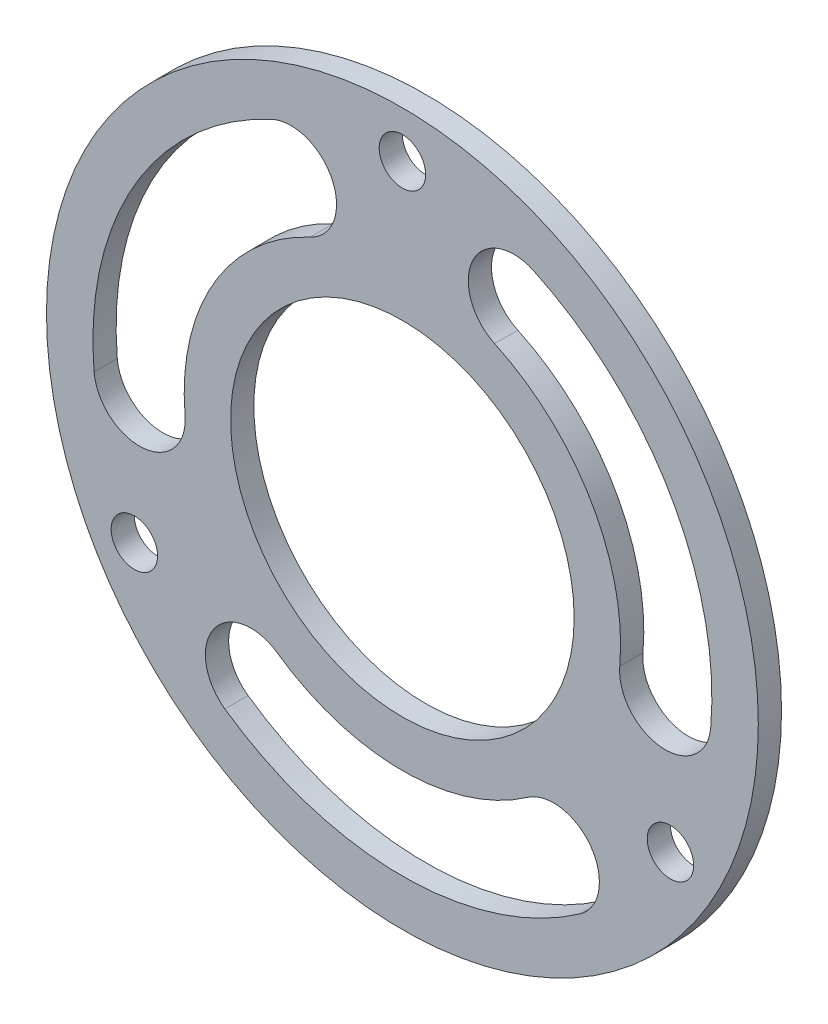
ISO-10303-21;
HEADER;
FILE_DESCRIPTION(('STEP AP214'),'2;1');
FILE_NAME('part.step','',(''),(''),'','','');
FILE_SCHEMA(('AUTOMOTIVE_DESIGN { 1 0 10303 214 1 1 1 1 }'));
ENDSEC;
DATA;
#1=APPLICATION_CONTEXT('core data for automotive mechanical design processes');
#2=APPLICATION_PROTOCOL_DEFINITION('international standard','automotive_design',2000,#1);
#3=PRODUCT_CONTEXT('',#1,'mechanical');
#4=PRODUCT('Part','Part','',(#3));
#5=PRODUCT_RELATED_PRODUCT_CATEGORY('part','',(#4));
#6=PRODUCT_DEFINITION_FORMATION('','',#4);
#7=PRODUCT_DEFINITION_CONTEXT('part definition',#1,'design');
#8=PRODUCT_DEFINITION('design','',#6,#7);
#9=PRODUCT_DEFINITION_SHAPE('','',#8);
#10=(LENGTH_UNIT() NAMED_UNIT(*) SI_UNIT(.MILLI.,.METRE.));
#11=(NAMED_UNIT(*) PLANE_ANGLE_UNIT() SI_UNIT($,.RADIAN.));
#12=(NAMED_UNIT(*) SI_UNIT($,.STERADIAN.) SOLID_ANGLE_UNIT());
#13=UNCERTAINTY_MEASURE_WITH_UNIT(LENGTH_MEASURE(1.E-05),#10,'distance_accuracy_value','');
#14=(GEOMETRIC_REPRESENTATION_CONTEXT(3) GLOBAL_UNCERTAINTY_ASSIGNED_CONTEXT((#13)) GLOBAL_UNIT_ASSIGNED_CONTEXT((#10,
#11,#12)) REPRESENTATION_CONTEXT('',''));
#15=CARTESIAN_POINT('',(0.,0.,0.));
#16=DIRECTION('',(0.,0.,1.));
#17=DIRECTION('',(1.,0.,0.));
#18=AXIS2_PLACEMENT_3D('',#15,#16,#17);
#19=CARTESIAN_POINT('',(0.,0.,1.5));
#20=DIRECTION('',(0.,0.,1.));
#21=DIRECTION('',(1.,0.,0.));
#22=AXIS2_PLACEMENT_3D('',#19,#20,#21);
#23=PLANE('',#22);
#24=CARTESIAN_POINT('',(-9.77947823978542,-13.9665423551273,1.5));
#25=DIRECTION('',(0.,0.,1.));
#26=DIRECTION('',(1.,0.,0.));
#27=AXIS2_PLACEMENT_3D('',#24,#25,#26);
#28=CIRCLE('',#27,2.95000000000001);
#29=CARTESIAN_POINT('',(-8.08742775254981,-11.5500438244747,1.5));
#30=VERTEX_POINT('',#29);
#31=CARTESIAN_POINT('',(-11.471528727021,-16.3830408857798,1.5));
#32=VERTEX_POINT('',#31);
#33=EDGE_CURVE('E49',#30,#32,#28,.T.);
#34=ORIENTED_EDGE('',*,*,#33,.F.);
#35=CARTESIAN_POINT('',(0.,0.,1.5));
#36=DIRECTION('',(0.,0.,-1.));
#37=DIRECTION('',(1.,0.,0.));
#38=AXIS2_PLACEMENT_3D('',#35,#36,#37);
#39=CIRCLE('',#38,14.1);
#40=CARTESIAN_POINT('',(8.08742775254982,-11.5500438244747,1.5));
#41=VERTEX_POINT('',#40);
#42=EDGE_CURVE('E168',#41,#30,#39,.T.);
#43=ORIENTED_EDGE('',*,*,#42,.F.);
#44=CARTESIAN_POINT('',(9.77947823978542,-13.9665423551272,1.5));
#45=DIRECTION('',(0.,0.,1.));
#46=DIRECTION('',(1.,0.,0.));
#47=AXIS2_PLACEMENT_3D('',#44,#45,#46);
#48=CIRCLE('',#47,2.95);
#49=CARTESIAN_POINT('',(11.471528727021,-16.3830408857798,1.5));
#50=VERTEX_POINT('',#49);
#51=EDGE_CURVE('E182',#50,#41,#48,.T.);
#52=ORIENTED_EDGE('',*,*,#51,.F.);
#53=CARTESIAN_POINT('',(0.,0.,1.5));
#54=DIRECTION('',(0.,0.,1.));
#55=DIRECTION('',(1.,0.,0.));
#56=AXIS2_PLACEMENT_3D('',#53,#54,#55);
#57=CIRCLE('',#56,20.);
#58=EDGE_CURVE('E179',#32,#50,#57,.T.);
#59=ORIENTED_EDGE('',*,*,#58,.F.);
#60=EDGE_LOOP('',(#34,#43,#52,#59));
#61=FACE_BOUND('',#60,.T.);
#62=CARTESIAN_POINT('',(16.9851196024642,-1.48600541384767,1.5));
#63=DIRECTION('',(0.,0.,1.));
#64=DIRECTION('',(1.,0.,0.));
#65=AXIS2_PLACEMENT_3D('',#62,#63,#64);
#66=CIRCLE('',#65,2.95);
#67=CARTESIAN_POINT('',(14.0463452430936,-1.22889597274206,1.5));
#68=VERTEX_POINT('',#67);
#69=CARTESIAN_POINT('',(19.9238939618349,-1.74311485495327,1.5));
#70=VERTEX_POINT('',#69);
#71=EDGE_CURVE('E57',#68,#70,#66,.T.);
#72=ORIENTED_EDGE('',*,*,#71,.F.);
#73=CARTESIAN_POINT('',(0.,0.,1.5));
#74=DIRECTION('',(0.,0.,-1.));
#75=DIRECTION('',(1.,0.,0.));
#76=AXIS2_PLACEMENT_3D('',#73,#74,#75);
#77=CIRCLE('',#76,14.1);
#78=CARTESIAN_POINT('',(5.95891749054378,12.7789397972168,1.5));
#79=VERTEX_POINT('',#78);
#80=EDGE_CURVE('E144',#79,#68,#77,.T.);
#81=ORIENTED_EDGE('',*,*,#80,.F.);
#82=CARTESIAN_POINT('',(7.20564136267882,15.4525477689749,1.5));
#83=DIRECTION('',(0.,0.,1.));
#84=DIRECTION('',(1.,0.,0.));
#85=AXIS2_PLACEMENT_3D('',#82,#83,#84);
#86=CIRCLE('',#85,2.95);
#87=CARTESIAN_POINT('',(8.45236523481387,18.1261557407331,1.5));
#88=VERTEX_POINT('',#87);
#89=EDGE_CURVE('E147',#88,#79,#86,.T.);
#90=ORIENTED_EDGE('',*,*,#89,.F.);
#91=CARTESIAN_POINT('',(0.,0.,1.5));
#92=DIRECTION('',(0.,0.,1.));
#93=DIRECTION('',(1.,0.,0.));
#94=AXIS2_PLACEMENT_3D('',#91,#92,#93);
#95=CIRCLE('',#94,20.);
#96=EDGE_CURVE('E153',#70,#88,#95,.T.);
#97=ORIENTED_EDGE('',*,*,#96,.F.);
#98=EDGE_LOOP('',(#72,#81,#90,#97));
#99=FACE_BOUND('',#98,.T.);
#100=CARTESIAN_POINT('',(-7.20564136267883,15.4525477689749,1.5));
#101=DIRECTION('',(0.,0.,1.));
#102=DIRECTION('',(1.,0.,0.));
#103=AXIS2_PLACEMENT_3D('',#100,#101,#102);
#104=CIRCLE('',#103,2.95);
#105=CARTESIAN_POINT('',(-5.95891749054379,12.7789397972168,1.5));
#106=VERTEX_POINT('',#105);
#107=CARTESIAN_POINT('',(-8.45236523481388,18.1261557407331,1.5));
#108=VERTEX_POINT('',#107);
#109=EDGE_CURVE('E160',#106,#108,#104,.T.);
#110=ORIENTED_EDGE('',*,*,#109,.F.);
#111=CARTESIAN_POINT('',(0.,0.,1.5));
#112=DIRECTION('',(0.,0.,-1.));
#113=DIRECTION('',(1.,0.,0.));
#114=AXIS2_PLACEMENT_3D('',#111,#112,#113);
#115=CIRCLE('',#114,14.1);
#116=CARTESIAN_POINT('',(-14.0463452430936,-1.22889597274207,1.5));
#117=VERTEX_POINT('',#116);
#118=EDGE_CURVE('E197',#117,#106,#115,.T.);
#119=ORIENTED_EDGE('',*,*,#118,.F.);
#120=CARTESIAN_POINT('',(-16.9851196024642,-1.48600541384768,1.5));
#121=DIRECTION('',(0.,0.,1.));
#122=DIRECTION('',(1.,0.,0.));
#123=AXIS2_PLACEMENT_3D('',#120,#121,#122);
#124=CIRCLE('',#123,2.95);
#125=CARTESIAN_POINT('',(-19.9238939618349,-1.74311485495329,1.5));
#126=VERTEX_POINT('',#125);
#127=EDGE_CURVE('E211',#126,#117,#124,.T.);
#128=ORIENTED_EDGE('',*,*,#127,.F.);
#129=CARTESIAN_POINT('',(0.,0.,1.5));
#130=DIRECTION('',(0.,0.,1.));
#131=DIRECTION('',(1.,0.,0.));
#132=AXIS2_PLACEMENT_3D('',#129,#130,#131);
#133=CIRCLE('',#132,20.);
#134=EDGE_CURVE('E208',#108,#126,#133,.T.);
#135=ORIENTED_EDGE('',*,*,#134,.F.);
#136=EDGE_LOOP('',(#110,#119,#128,#135));
#137=FACE_BOUND('',#136,.T.);
#138=CARTESIAN_POINT('',(-17.3205080756888,-10.,1.5));
#139=DIRECTION('',(0.,0.,1.));
#140=DIRECTION('',(1.,0.,0.));
#141=AXIS2_PLACEMENT_3D('',#138,#139,#140);
#142=CIRCLE('',#141,1.5);
#143=CARTESIAN_POINT('',(-15.8205080756888,-10.,1.5));
#144=VERTEX_POINT('',#143);
#145=EDGE_CURVE('E231',#144,#144,#142,.T.);
#146=ORIENTED_EDGE('',*,*,#145,.F.);
#147=EDGE_LOOP('',(#146));
#148=FACE_BOUND('',#147,.T.);
#149=CARTESIAN_POINT('',(0.,20.,1.5));
#150=DIRECTION('',(0.,0.,1.));
#151=DIRECTION('',(1.,0.,0.));
#152=AXIS2_PLACEMENT_3D('',#149,#150,#151);
#153=CIRCLE('',#152,1.5);
#154=CARTESIAN_POINT('',(1.5,20.,1.5));
#155=VERTEX_POINT('',#154);
#156=EDGE_CURVE('E243',#155,#155,#153,.T.);
#157=ORIENTED_EDGE('',*,*,#156,.F.);
#158=EDGE_LOOP('',(#157));
#159=FACE_BOUND('',#158,.T.);
#160=CARTESIAN_POINT('',(0.,0.,1.5));
#161=DIRECTION('',(0.,0.,1.));
#162=DIRECTION('',(1.,0.,0.));
#163=AXIS2_PLACEMENT_3D('',#160,#161,#162);
#164=CIRCLE('',#163,23.);
#165=CARTESIAN_POINT('',(23.,0.,1.5));
#166=VERTEX_POINT('',#165);
#167=EDGE_CURVE('E11',#166,#166,#164,.T.);
#168=ORIENTED_EDGE('',*,*,#167,.T.);
#169=EDGE_LOOP('',(#168));
#170=FACE_BOUND('',#169,.T.);
#171=CARTESIAN_POINT('',(17.3205080756888,-10.,1.5));
#172=DIRECTION('',(0.,0.,1.));
#173=DIRECTION('',(1.,0.,0.));
#174=AXIS2_PLACEMENT_3D('',#171,#172,#173);
#175=CIRCLE('',#174,1.5);
#176=CARTESIAN_POINT('',(18.8205080756888,-10.,1.5));
#177=VERTEX_POINT('',#176);
#178=EDGE_CURVE('E237',#177,#177,#175,.T.);
#179=ORIENTED_EDGE('',*,*,#178,.F.);
#180=EDGE_LOOP('',(#179));
#181=FACE_BOUND('',#180,.T.);
#182=CARTESIAN_POINT('',(0.,0.,1.5));
#183=DIRECTION('',(0.,0.,1.));
#184=DIRECTION('',(1.,0.,0.));
#185=AXIS2_PLACEMENT_3D('',#182,#183,#184);
#186=CIRCLE('',#185,11.1);
#187=CARTESIAN_POINT('',(11.1,0.,1.5));
#188=VERTEX_POINT('',#187);
#189=EDGE_CURVE('E225',#188,#188,#186,.T.);
#190=ORIENTED_EDGE('',*,*,#189,.F.);
#191=EDGE_LOOP('',(#190));
#192=FACE_BOUND('',#191,.T.);
#193=ADVANCED_FACE('F34',(#61,#99,#137,#148,#159,#170,#181,#192),#23,.T.);
#194=CARTESIAN_POINT('',(0.,0.,0.));
#195=DIRECTION('',(0.,0.,1.));
#196=DIRECTION('',(1.,0.,0.));
#197=AXIS2_PLACEMENT_3D('',#194,#195,#196);
#198=PLANE('',#197);
#199=CARTESIAN_POINT('',(0.,0.,0.));
#200=DIRECTION('',(0.,0.,-1.));
#201=DIRECTION('',(1.,0.,0.));
#202=AXIS2_PLACEMENT_3D('',#199,#200,#201);
#203=CIRCLE('',#202,14.1);
#204=CARTESIAN_POINT('',(8.08742775254982,-11.5500438244747,0.));
#205=VERTEX_POINT('',#204);
#206=CARTESIAN_POINT('',(-8.08742775254981,-11.5500438244747,0.));
#207=VERTEX_POINT('',#206);
#208=EDGE_CURVE('E174',#205,#207,#203,.T.);
#209=ORIENTED_EDGE('',*,*,#208,.T.);
#210=CARTESIAN_POINT('',(-9.77947823978542,-13.9665423551273,0.));
#211=DIRECTION('',(0.,0.,1.));
#212=DIRECTION('',(1.,0.,0.));
#213=AXIS2_PLACEMENT_3D('',#210,#211,#212);
#214=CIRCLE('',#213,2.95000000000001);
#215=CARTESIAN_POINT('',(-11.471528727021,-16.3830408857798,0.));
#216=VERTEX_POINT('',#215);
#217=EDGE_CURVE('E164',#207,#216,#214,.T.);
#218=ORIENTED_EDGE('',*,*,#217,.T.);
#219=CARTESIAN_POINT('',(0.,0.,0.));
#220=DIRECTION('',(0.,0.,1.));
#221=DIRECTION('',(1.,0.,0.));
#222=AXIS2_PLACEMENT_3D('',#219,#220,#221);
#223=CIRCLE('',#222,20.);
#224=CARTESIAN_POINT('',(11.471528727021,-16.3830408857798,0.));
#225=VERTEX_POINT('',#224);
#226=EDGE_CURVE('E167',#216,#225,#223,.T.);
#227=ORIENTED_EDGE('',*,*,#226,.T.);
#228=CARTESIAN_POINT('',(9.77947823978542,-13.9665423551272,0.));
#229=DIRECTION('',(0.,0.,1.));
#230=DIRECTION('',(1.,0.,0.));
#231=AXIS2_PLACEMENT_3D('',#228,#229,#230);
#232=CIRCLE('',#231,2.95);
#233=EDGE_CURVE('E171',#225,#205,#232,.T.);
#234=ORIENTED_EDGE('',*,*,#233,.T.);
#235=EDGE_LOOP('',(#209,#218,#227,#234));
#236=FACE_BOUND('',#235,.T.);
#237=CARTESIAN_POINT('',(0.,0.,0.));
#238=DIRECTION('',(0.,0.,-1.));
#239=DIRECTION('',(1.,0.,0.));
#240=AXIS2_PLACEMENT_3D('',#237,#238,#239);
#241=CIRCLE('',#240,14.1);
#242=CARTESIAN_POINT('',(5.95891749054378,12.7789397972168,0.));
#243=VERTEX_POINT('',#242);
#244=CARTESIAN_POINT('',(14.0463452430936,-1.22889597274206,0.));
#245=VERTEX_POINT('',#244);
#246=EDGE_CURVE('E131',#243,#245,#241,.T.);
#247=ORIENTED_EDGE('',*,*,#246,.T.);
#248=CARTESIAN_POINT('',(16.9851196024642,-1.48600541384767,0.));
#249=DIRECTION('',(0.,0.,1.));
#250=DIRECTION('',(1.,0.,0.));
#251=AXIS2_PLACEMENT_3D('',#248,#249,#250);
#252=CIRCLE('',#251,2.95);
#253=CARTESIAN_POINT('',(19.9238939618349,-1.74311485495327,0.));
#254=VERTEX_POINT('',#253);
#255=EDGE_CURVE('E125',#245,#254,#252,.T.);
#256=ORIENTED_EDGE('',*,*,#255,.T.);
#257=CARTESIAN_POINT('',(0.,0.,0.));
#258=DIRECTION('',(0.,0.,1.));
#259=DIRECTION('',(1.,0.,0.));
#260=AXIS2_PLACEMENT_3D('',#257,#258,#259);
#261=CIRCLE('',#260,20.);
#262=CARTESIAN_POINT('',(8.45236523481387,18.1261557407331,0.));
#263=VERTEX_POINT('',#262);
#264=EDGE_CURVE('E135',#254,#263,#261,.T.);
#265=ORIENTED_EDGE('',*,*,#264,.T.);
#266=CARTESIAN_POINT('',(7.20564136267882,15.4525477689749,0.));
#267=DIRECTION('',(0.,0.,1.));
#268=DIRECTION('',(1.,0.,0.));
#269=AXIS2_PLACEMENT_3D('',#266,#267,#268);
#270=CIRCLE('',#269,2.95);
#271=EDGE_CURVE('E139',#263,#243,#270,.T.);
#272=ORIENTED_EDGE('',*,*,#271,.T.);
#273=EDGE_LOOP('',(#247,#256,#265,#272));
#274=FACE_BOUND('',#273,.T.);
#275=CARTESIAN_POINT('',(0.,0.,0.));
#276=DIRECTION('',(0.,0.,-1.));
#277=DIRECTION('',(1.,0.,0.));
#278=AXIS2_PLACEMENT_3D('',#275,#276,#277);
#279=CIRCLE('',#278,14.1);
#280=CARTESIAN_POINT('',(-14.0463452430936,-1.22889597274207,0.));
#281=VERTEX_POINT('',#280);
#282=CARTESIAN_POINT('',(-5.95891749054379,12.7789397972168,0.));
#283=VERTEX_POINT('',#282);
#284=EDGE_CURVE('E203',#281,#283,#279,.T.);
#285=ORIENTED_EDGE('',*,*,#284,.T.);
#286=CARTESIAN_POINT('',(-7.20564136267883,15.4525477689749,0.));
#287=DIRECTION('',(0.,0.,1.));
#288=DIRECTION('',(1.,0.,0.));
#289=AXIS2_PLACEMENT_3D('',#286,#287,#288);
#290=CIRCLE('',#289,2.95);
#291=CARTESIAN_POINT('',(-8.45236523481388,18.1261557407331,0.));
#292=VERTEX_POINT('',#291);
#293=EDGE_CURVE('E193',#283,#292,#290,.T.);
#294=ORIENTED_EDGE('',*,*,#293,.T.);
#295=CARTESIAN_POINT('',(0.,0.,0.));
#296=DIRECTION('',(0.,0.,1.));
#297=DIRECTION('',(1.,0.,0.));
#298=AXIS2_PLACEMENT_3D('',#295,#296,#297);
#299=CIRCLE('',#298,20.);
#300=CARTESIAN_POINT('',(-19.9238939618349,-1.74311485495329,0.));
#301=VERTEX_POINT('',#300);
#302=EDGE_CURVE('E196',#292,#301,#299,.T.);
#303=ORIENTED_EDGE('',*,*,#302,.T.);
#304=CARTESIAN_POINT('',(-16.9851196024642,-1.48600541384768,0.));
#305=DIRECTION('',(0.,0.,1.));
#306=DIRECTION('',(1.,0.,0.));
#307=AXIS2_PLACEMENT_3D('',#304,#305,#306);
#308=CIRCLE('',#307,2.95);
#309=EDGE_CURVE('E200',#301,#281,#308,.T.);
#310=ORIENTED_EDGE('',*,*,#309,.T.);
#311=EDGE_LOOP('',(#285,#294,#303,#310));
#312=FACE_BOUND('',#311,.T.);
#313=CARTESIAN_POINT('',(0.,0.,0.));
#314=DIRECTION('',(0.,0.,1.));
#315=DIRECTION('',(1.,0.,0.));
#316=AXIS2_PLACEMENT_3D('',#313,#314,#315);
#317=CIRCLE('',#316,23.);
#318=CARTESIAN_POINT('',(23.,0.,0.));
#319=VERTEX_POINT('',#318);
#320=EDGE_CURVE('E38',#319,#319,#317,.T.);
#321=ORIENTED_EDGE('',*,*,#320,.F.);
#322=EDGE_LOOP('',(#321));
#323=FACE_BOUND('',#322,.T.);
#324=CARTESIAN_POINT('',(0.,20.,0.));
#325=DIRECTION('',(0.,0.,1.));
#326=DIRECTION('',(1.,0.,0.));
#327=AXIS2_PLACEMENT_3D('',#324,#325,#326);
#328=CIRCLE('',#327,1.5);
#329=CARTESIAN_POINT('',(1.5,20.,0.));
#330=VERTEX_POINT('',#329);
#331=EDGE_CURVE('E240',#330,#330,#328,.T.);
#332=ORIENTED_EDGE('',*,*,#331,.T.);
#333=EDGE_LOOP('',(#332));
#334=FACE_BOUND('',#333,.T.);
#335=CARTESIAN_POINT('',(17.3205080756888,-10.,0.));
#336=DIRECTION('',(0.,0.,1.));
#337=DIRECTION('',(1.,0.,0.));
#338=AXIS2_PLACEMENT_3D('',#335,#336,#337);
#339=CIRCLE('',#338,1.5);
#340=CARTESIAN_POINT('',(18.8205080756888,-10.,0.));
#341=VERTEX_POINT('',#340);
#342=EDGE_CURVE('E234',#341,#341,#339,.T.);
#343=ORIENTED_EDGE('',*,*,#342,.T.);
#344=EDGE_LOOP('',(#343));
#345=FACE_BOUND('',#344,.T.);
#346=CARTESIAN_POINT('',(-17.3205080756888,-10.,0.));
#347=DIRECTION('',(0.,0.,1.));
#348=DIRECTION('',(1.,0.,0.));
#349=AXIS2_PLACEMENT_3D('',#346,#347,#348);
#350=CIRCLE('',#349,1.5);
#351=CARTESIAN_POINT('',(-15.8205080756888,-10.,0.));
#352=VERTEX_POINT('',#351);
#353=EDGE_CURVE('E228',#352,#352,#350,.T.);
#354=ORIENTED_EDGE('',*,*,#353,.T.);
#355=EDGE_LOOP('',(#354));
#356=FACE_BOUND('',#355,.T.);
#357=CARTESIAN_POINT('',(0.,0.,0.));
#358=DIRECTION('',(0.,0.,1.));
#359=DIRECTION('',(1.,0.,0.));
#360=AXIS2_PLACEMENT_3D('',#357,#358,#359);
#361=CIRCLE('',#360,11.1);
#362=CARTESIAN_POINT('',(11.1,0.,0.));
#363=VERTEX_POINT('',#362);
#364=EDGE_CURVE('E218',#363,#363,#361,.T.);
#365=ORIENTED_EDGE('',*,*,#364,.T.);
#366=EDGE_LOOP('',(#365));
#367=FACE_BOUND('',#366,.T.);
#368=ADVANCED_FACE('F141',(#236,#274,#312,#323,#334,#345,#356,#367),#198,.F.);
#369=CARTESIAN_POINT('',(0.,0.,1.5));
#370=DIRECTION('',(0.,0.,-1.));
#371=DIRECTION('',(-1.,0.,0.));
#372=AXIS2_PLACEMENT_3D('',#369,#370,#371);
#373=CYLINDRICAL_SURFACE('',#372,23.);
#374=ORIENTED_EDGE('',*,*,#167,.F.);
#375=EDGE_LOOP('',(#374));
#376=FACE_BOUND('',#375,.T.);
#377=ORIENTED_EDGE('',*,*,#320,.T.);
#378=EDGE_LOOP('',(#377));
#379=FACE_BOUND('',#378,.T.);
#380=ADVANCED_FACE('F36',(#376,#379),#373,.T.);
#381=CARTESIAN_POINT('',(0.,20.,1.5));
#382=DIRECTION('',(0.,0.,-1.));
#383=DIRECTION('',(-1.,0.,0.));
#384=AXIS2_PLACEMENT_3D('',#381,#382,#383);
#385=CYLINDRICAL_SURFACE('',#384,1.5);
#386=ORIENTED_EDGE('',*,*,#156,.T.);
#387=EDGE_LOOP('',(#386));
#388=FACE_BOUND('',#387,.T.);
#389=ORIENTED_EDGE('',*,*,#331,.F.);
#390=EDGE_LOOP('',(#389));
#391=FACE_BOUND('',#390,.T.);
#392=ADVANCED_FACE('F251',(#388,#391),#385,.F.);
#393=CARTESIAN_POINT('',(17.3205080756888,-10.,1.5));
#394=DIRECTION('',(0.,0.,-1.));
#395=DIRECTION('',(-1.,0.,0.));
#396=AXIS2_PLACEMENT_3D('',#393,#394,#395);
#397=CYLINDRICAL_SURFACE('',#396,1.5);
#398=ORIENTED_EDGE('',*,*,#178,.T.);
#399=EDGE_LOOP('',(#398));
#400=FACE_BOUND('',#399,.T.);
#401=ORIENTED_EDGE('',*,*,#342,.F.);
#402=EDGE_LOOP('',(#401));
#403=FACE_BOUND('',#402,.T.);
#404=ADVANCED_FACE('F253',(#400,#403),#397,.F.);
#405=CARTESIAN_POINT('',(-17.3205080756888,-10.,1.5));
#406=DIRECTION('',(0.,0.,-1.));
#407=DIRECTION('',(-1.,0.,0.));
#408=AXIS2_PLACEMENT_3D('',#405,#406,#407);
#409=CYLINDRICAL_SURFACE('',#408,1.5);
#410=ORIENTED_EDGE('',*,*,#145,.T.);
#411=EDGE_LOOP('',(#410));
#412=FACE_BOUND('',#411,.T.);
#413=ORIENTED_EDGE('',*,*,#353,.F.);
#414=EDGE_LOOP('',(#413));
#415=FACE_BOUND('',#414,.T.);
#416=ADVANCED_FACE('F260',(#412,#415),#409,.F.);
#417=CARTESIAN_POINT('',(0.,0.,1.5));
#418=DIRECTION('',(0.,0.,-1.));
#419=DIRECTION('',(-1.,0.,0.));
#420=AXIS2_PLACEMENT_3D('',#417,#418,#419);
#421=CYLINDRICAL_SURFACE('',#420,11.1);
#422=ORIENTED_EDGE('',*,*,#189,.T.);
#423=EDGE_LOOP('',(#422));
#424=FACE_BOUND('',#423,.T.);
#425=ORIENTED_EDGE('',*,*,#364,.F.);
#426=EDGE_LOOP('',(#425));
#427=FACE_BOUND('',#426,.T.);
#428=ADVANCED_FACE('F290',(#424,#427),#421,.F.);
#429=CARTESIAN_POINT('',(-7.20564136267883,15.4525477689749,0.));
#430=DIRECTION('',(0.,0.,1.));
#431=DIRECTION('',(1.,0.,0.));
#432=AXIS2_PLACEMENT_3D('',#429,#430,#431);
#433=CYLINDRICAL_SURFACE('',#432,2.95);
#434=ORIENTED_EDGE('',*,*,#109,.T.);
#435=DIRECTION('',(0.,0.,1.));
#436=VECTOR('',#435,1.);
#437=CARTESIAN_POINT('',(-8.45236523481388,18.1261557407331,0.));
#438=LINE('',#437,#436);
#439=EDGE_CURVE('E206',#292,#108,#438,.T.);
#440=ORIENTED_EDGE('',*,*,#439,.F.);
#441=ORIENTED_EDGE('',*,*,#293,.F.);
#442=DIRECTION('',(0.,0.,1.));
#443=VECTOR('',#442,1.);
#444=CARTESIAN_POINT('',(-5.95891749054379,12.7789397972168,0.));
#445=LINE('',#444,#443);
#446=EDGE_CURVE('E216',#283,#106,#445,.T.);
#447=ORIENTED_EDGE('',*,*,#446,.T.);
#448=EDGE_LOOP('',(#434,#440,#441,#447));
#449=FACE_BOUND('',#448,.T.);
#450=ADVANCED_FACE('F293',(#449),#433,.F.);
#451=CARTESIAN_POINT('',(0.,0.,0.));
#452=DIRECTION('',(0.,0.,1.));
#453=DIRECTION('',(1.,0.,0.));
#454=AXIS2_PLACEMENT_3D('',#451,#452,#453);
#455=CYLINDRICAL_SURFACE('',#454,14.1);
#456=ORIENTED_EDGE('',*,*,#118,.T.);
#457=ORIENTED_EDGE('',*,*,#446,.F.);
#458=ORIENTED_EDGE('',*,*,#284,.F.);
#459=DIRECTION('',(0.,0.,1.));
#460=VECTOR('',#459,1.);
#461=CARTESIAN_POINT('',(-14.0463452430936,-1.22889597274207,0.));
#462=LINE('',#461,#460);
#463=EDGE_CURVE('E219',#281,#117,#462,.T.);
#464=ORIENTED_EDGE('',*,*,#463,.T.);
#465=EDGE_LOOP('',(#456,#457,#458,#464));
#466=FACE_BOUND('',#465,.T.);
#467=ADVANCED_FACE('F301',(#466),#455,.T.);
#468=CARTESIAN_POINT('',(-16.9851196024642,-1.48600541384768,0.));
#469=DIRECTION('',(0.,0.,1.));
#470=DIRECTION('',(1.,0.,0.));
#471=AXIS2_PLACEMENT_3D('',#468,#469,#470);
#472=CYLINDRICAL_SURFACE('',#471,2.95);
#473=ORIENTED_EDGE('',*,*,#127,.T.);
#474=ORIENTED_EDGE('',*,*,#463,.F.);
#475=ORIENTED_EDGE('',*,*,#309,.F.);
#476=DIRECTION('',(0.,0.,1.));
#477=VECTOR('',#476,1.);
#478=CARTESIAN_POINT('',(-19.9238939618349,-1.74311485495329,0.));
#479=LINE('',#478,#477);
#480=EDGE_CURVE('E221',#301,#126,#479,.T.);
#481=ORIENTED_EDGE('',*,*,#480,.T.);
#482=EDGE_LOOP('',(#473,#474,#475,#481));
#483=FACE_BOUND('',#482,.T.);
#484=ADVANCED_FACE('F310',(#483),#472,.F.);
#485=CARTESIAN_POINT('',(0.,0.,0.));
#486=DIRECTION('',(0.,0.,1.));
#487=DIRECTION('',(1.,0.,0.));
#488=AXIS2_PLACEMENT_3D('',#485,#486,#487);
#489=CYLINDRICAL_SURFACE('',#488,20.);
#490=ORIENTED_EDGE('',*,*,#134,.T.);
#491=ORIENTED_EDGE('',*,*,#480,.F.);
#492=ORIENTED_EDGE('',*,*,#302,.F.);
#493=ORIENTED_EDGE('',*,*,#439,.T.);
#494=EDGE_LOOP('',(#490,#491,#492,#493));
#495=FACE_BOUND('',#494,.T.);
#496=ADVANCED_FACE('F307',(#495),#489,.F.);
#497=CARTESIAN_POINT('',(16.9851196024642,-1.48600541384767,0.));
#498=DIRECTION('',(0.,0.,1.));
#499=DIRECTION('',(1.,0.,0.));
#500=AXIS2_PLACEMENT_3D('',#497,#498,#499);
#501=CYLINDRICAL_SURFACE('',#500,2.95);
#502=ORIENTED_EDGE('',*,*,#71,.T.);
#503=DIRECTION('',(0.,0.,1.));
#504=VECTOR('',#503,1.);
#505=CARTESIAN_POINT('',(19.9238939618349,-1.74311485495327,0.));
#506=LINE('',#505,#504);
#507=EDGE_CURVE('E121',#254,#70,#506,.T.);
#508=ORIENTED_EDGE('',*,*,#507,.F.);
#509=ORIENTED_EDGE('',*,*,#255,.F.);
#510=DIRECTION('',(0.,0.,1.));
#511=VECTOR('',#510,1.);
#512=CARTESIAN_POINT('',(14.0463452430936,-1.22889597274206,0.));
#513=LINE('',#512,#511);
#514=EDGE_CURVE('E158',#245,#68,#513,.T.);
#515=ORIENTED_EDGE('',*,*,#514,.T.);
#516=EDGE_LOOP('',(#502,#508,#509,#515));
#517=FACE_BOUND('',#516,.T.);
#518=ADVANCED_FACE('F123',(#517),#501,.F.);
#519=CARTESIAN_POINT('',(0.,0.,0.));
#520=DIRECTION('',(0.,0.,1.));
#521=DIRECTION('',(1.,0.,0.));
#522=AXIS2_PLACEMENT_3D('',#519,#520,#521);
#523=CYLINDRICAL_SURFACE('',#522,14.1);
#524=ORIENTED_EDGE('',*,*,#80,.T.);
#525=ORIENTED_EDGE('',*,*,#514,.F.);
#526=ORIENTED_EDGE('',*,*,#246,.F.);
#527=DIRECTION('',(0.,0.,1.));
#528=VECTOR('',#527,1.);
#529=CARTESIAN_POINT('',(5.95891749054378,12.7789397972168,0.));
#530=LINE('',#529,#528);
#531=EDGE_CURVE('E161',#243,#79,#530,.T.);
#532=ORIENTED_EDGE('',*,*,#531,.T.);
#533=EDGE_LOOP('',(#524,#525,#526,#532));
#534=FACE_BOUND('',#533,.T.);
#535=ADVANCED_FACE('F335',(#534),#523,.T.);
#536=CARTESIAN_POINT('',(7.20564136267882,15.4525477689749,0.));
#537=DIRECTION('',(0.,0.,1.));
#538=DIRECTION('',(1.,0.,0.));
#539=AXIS2_PLACEMENT_3D('',#536,#537,#538);
#540=CYLINDRICAL_SURFACE('',#539,2.95);
#541=ORIENTED_EDGE('',*,*,#89,.T.);
#542=ORIENTED_EDGE('',*,*,#531,.F.);
#543=ORIENTED_EDGE('',*,*,#271,.F.);
#544=DIRECTION('',(0.,0.,1.));
#545=VECTOR('',#544,1.);
#546=CARTESIAN_POINT('',(8.45236523481387,18.1261557407331,0.));
#547=LINE('',#546,#545);
#548=EDGE_CURVE('E130',#263,#88,#547,.T.);
#549=ORIENTED_EDGE('',*,*,#548,.T.);
#550=EDGE_LOOP('',(#541,#542,#543,#549));
#551=FACE_BOUND('',#550,.T.);
#552=ADVANCED_FACE('F338',(#551),#540,.F.);
#553=CARTESIAN_POINT('',(0.,0.,0.));
#554=DIRECTION('',(0.,0.,1.));
#555=DIRECTION('',(1.,0.,0.));
#556=AXIS2_PLACEMENT_3D('',#553,#554,#555);
#557=CYLINDRICAL_SURFACE('',#556,20.);
#558=ORIENTED_EDGE('',*,*,#96,.T.);
#559=ORIENTED_EDGE('',*,*,#548,.F.);
#560=ORIENTED_EDGE('',*,*,#264,.F.);
#561=ORIENTED_EDGE('',*,*,#507,.T.);
#562=EDGE_LOOP('',(#558,#559,#560,#561));
#563=FACE_BOUND('',#562,.T.);
#564=ADVANCED_FACE('F136',(#563),#557,.F.);
#565=CARTESIAN_POINT('',(-9.77947823978542,-13.9665423551273,0.));
#566=DIRECTION('',(0.,0.,1.));
#567=DIRECTION('',(1.,0.,0.));
#568=AXIS2_PLACEMENT_3D('',#565,#566,#567);
#569=CYLINDRICAL_SURFACE('',#568,2.95000000000001);
#570=ORIENTED_EDGE('',*,*,#33,.T.);
#571=DIRECTION('',(0.,0.,1.));
#572=VECTOR('',#571,1.);
#573=CARTESIAN_POINT('',(-11.471528727021,-16.3830408857798,0.));
#574=LINE('',#573,#572);
#575=EDGE_CURVE('E177',#216,#32,#574,.T.);
#576=ORIENTED_EDGE('',*,*,#575,.F.);
#577=ORIENTED_EDGE('',*,*,#217,.F.);
#578=DIRECTION('',(0.,0.,1.));
#579=VECTOR('',#578,1.);
#580=CARTESIAN_POINT('',(-8.08742775254981,-11.5500438244747,0.));
#581=LINE('',#580,#579);
#582=EDGE_CURVE('E154',#207,#30,#581,.T.);
#583=ORIENTED_EDGE('',*,*,#582,.T.);
#584=EDGE_LOOP('',(#570,#576,#577,#583));
#585=FACE_BOUND('',#584,.T.);
#586=ADVANCED_FACE('F318',(#585),#569,.F.);
#587=CARTESIAN_POINT('',(0.,0.,0.));
#588=DIRECTION('',(0.,0.,1.));
#589=DIRECTION('',(1.,0.,0.));
#590=AXIS2_PLACEMENT_3D('',#587,#588,#589);
#591=CYLINDRICAL_SURFACE('',#590,14.1);
#592=ORIENTED_EDGE('',*,*,#42,.T.);
#593=ORIENTED_EDGE('',*,*,#582,.F.);
#594=ORIENTED_EDGE('',*,*,#208,.F.);
#595=DIRECTION('',(0.,0.,1.));
#596=VECTOR('',#595,1.);
#597=CARTESIAN_POINT('',(8.08742775254982,-11.5500438244747,0.));
#598=LINE('',#597,#596);
#599=EDGE_CURVE('E188',#205,#41,#598,.T.);
#600=ORIENTED_EDGE('',*,*,#599,.T.);
#601=EDGE_LOOP('',(#592,#593,#594,#600));
#602=FACE_BOUND('',#601,.T.);
#603=ADVANCED_FACE('F321',(#602),#591,.T.);
#604=CARTESIAN_POINT('',(9.77947823978542,-13.9665423551272,0.));
#605=DIRECTION('',(0.,0.,1.));
#606=DIRECTION('',(1.,0.,0.));
#607=AXIS2_PLACEMENT_3D('',#604,#605,#606);
#608=CYLINDRICAL_SURFACE('',#607,2.95);
#609=ORIENTED_EDGE('',*,*,#51,.T.);
#610=ORIENTED_EDGE('',*,*,#599,.F.);
#611=ORIENTED_EDGE('',*,*,#233,.F.);
#612=DIRECTION('',(0.,0.,1.));
#613=VECTOR('',#612,1.);
#614=CARTESIAN_POINT('',(11.471528727021,-16.3830408857798,0.));
#615=LINE('',#614,#613);
#616=EDGE_CURVE('E190',#225,#50,#615,.T.);
#617=ORIENTED_EDGE('',*,*,#616,.T.);
#618=EDGE_LOOP('',(#609,#610,#611,#617));
#619=FACE_BOUND('',#618,.T.);
#620=ADVANCED_FACE('F325',(#619),#608,.F.);
#621=CARTESIAN_POINT('',(0.,0.,0.));
#622=DIRECTION('',(0.,0.,1.));
#623=DIRECTION('',(1.,0.,0.));
#624=AXIS2_PLACEMENT_3D('',#621,#622,#623);
#625=CYLINDRICAL_SURFACE('',#624,20.);
#626=ORIENTED_EDGE('',*,*,#58,.T.);
#627=ORIENTED_EDGE('',*,*,#616,.F.);
#628=ORIENTED_EDGE('',*,*,#226,.F.);
#629=ORIENTED_EDGE('',*,*,#575,.T.);
#630=EDGE_LOOP('',(#626,#627,#628,#629));
#631=FACE_BOUND('',#630,.T.);
#632=ADVANCED_FACE('F322',(#631),#625,.F.);
#633=CLOSED_SHELL('',(#193,#368,#380,#392,#404,#416,#428,#450,#467,#484,#496,#518,#535,#552,
#564,#586,#603,#620,#632));
#634=MANIFOLD_SOLID_BREP('B2',#633);
#635=ADVANCED_BREP_SHAPE_REPRESENTATION('',(#18,#634),#14);
#636=SHAPE_DEFINITION_REPRESENTATION(#9,#635);
ENDSEC;
END-ISO-10303-21;
